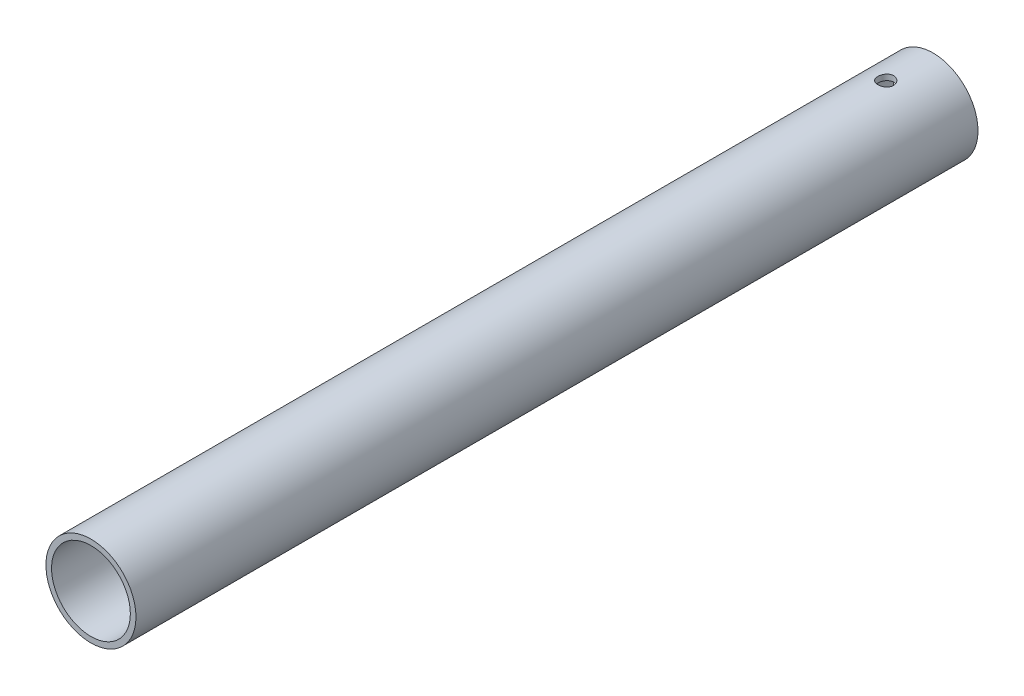
ISO-10303-21;
HEADER;
FILE_DESCRIPTION(('STEP AP214'),'2;1');
FILE_NAME('part.step','',(''),(''),'','','');
FILE_SCHEMA(('AUTOMOTIVE_DESIGN { 1 0 10303 214 1 1 1 1 }'));
ENDSEC;
DATA;
#1=APPLICATION_CONTEXT('core data for automotive mechanical design processes');
#2=APPLICATION_PROTOCOL_DEFINITION('international standard','automotive_design',2000,#1);
#3=PRODUCT_CONTEXT('',#1,'mechanical');
#4=PRODUCT('Part','Part','',(#3));
#5=PRODUCT_RELATED_PRODUCT_CATEGORY('part','',(#4));
#6=PRODUCT_DEFINITION_FORMATION('','',#4);
#7=PRODUCT_DEFINITION_CONTEXT('part definition',#1,'design');
#8=PRODUCT_DEFINITION('design','',#6,#7);
#9=PRODUCT_DEFINITION_SHAPE('','',#8);
#10=(LENGTH_UNIT() NAMED_UNIT(*) SI_UNIT(.MILLI.,.METRE.));
#11=(NAMED_UNIT(*) PLANE_ANGLE_UNIT() SI_UNIT($,.RADIAN.));
#12=(NAMED_UNIT(*) SI_UNIT($,.STERADIAN.) SOLID_ANGLE_UNIT());
#13=UNCERTAINTY_MEASURE_WITH_UNIT(LENGTH_MEASURE(1.E-05),#10,'distance_accuracy_value','');
#14=(GEOMETRIC_REPRESENTATION_CONTEXT(3) GLOBAL_UNCERTAINTY_ASSIGNED_CONTEXT((#13)) GLOBAL_UNIT_ASSIGNED_CONTEXT((#10,
#11,#12)) REPRESENTATION_CONTEXT('',''));
#15=CARTESIAN_POINT('',(0.,0.,0.));
#16=DIRECTION('',(0.,0.,1.));
#17=DIRECTION('',(1.,0.,0.));
#18=AXIS2_PLACEMENT_3D('',#15,#16,#17);
#19=CARTESIAN_POINT('',(0.,0.,149.6));
#20=DIRECTION('',(0.,0.,1.));
#21=DIRECTION('',(1.,0.,0.));
#22=AXIS2_PLACEMENT_3D('',#19,#20,#21);
#23=PLANE('',#22);
#24=CARTESIAN_POINT('',(0.,0.,149.6));
#25=DIRECTION('',(0.,0.,1.));
#26=DIRECTION('',(1.,0.,0.));
#27=AXIS2_PLACEMENT_3D('',#24,#25,#26);
#28=CIRCLE('',#27,8.);
#29=CARTESIAN_POINT('',(8.,0.,149.6));
#30=VERTEX_POINT('',#29);
#31=EDGE_CURVE('E10',#30,#30,#28,.T.);
#32=ORIENTED_EDGE('',*,*,#31,.T.);
#33=EDGE_LOOP('',(#32));
#34=FACE_BOUND('',#33,.T.);
#35=CARTESIAN_POINT('',(0.,0.,149.6));
#36=DIRECTION('',(0.,0.,1.));
#37=DIRECTION('',(1.,0.,0.));
#38=AXIS2_PLACEMENT_3D('',#35,#36,#37);
#39=CIRCLE('',#38,7.);
#40=CARTESIAN_POINT('',(7.,0.,149.6));
#41=VERTEX_POINT('',#40);
#42=EDGE_CURVE('E51',#41,#41,#39,.T.);
#43=ORIENTED_EDGE('',*,*,#42,.F.);
#44=EDGE_LOOP('',(#43));
#45=FACE_BOUND('',#44,.T.);
#46=ADVANCED_FACE('F33',(#34,#45),#23,.T.);
#47=CARTESIAN_POINT('',(0.,0.,0.));
#48=DIRECTION('',(0.,0.,1.));
#49=DIRECTION('',(1.,0.,0.));
#50=AXIS2_PLACEMENT_3D('',#47,#48,#49);
#51=PLANE('',#50);
#52=CARTESIAN_POINT('',(0.,0.,0.));
#53=DIRECTION('',(0.,0.,1.));
#54=DIRECTION('',(1.,0.,0.));
#55=AXIS2_PLACEMENT_3D('',#52,#53,#54);
#56=CIRCLE('',#55,8.);
#57=CARTESIAN_POINT('',(8.,0.,0.));
#58=VERTEX_POINT('',#57);
#59=EDGE_CURVE('E46',#58,#58,#56,.T.);
#60=ORIENTED_EDGE('',*,*,#59,.F.);
#61=EDGE_LOOP('',(#60));
#62=FACE_BOUND('',#61,.T.);
#63=CARTESIAN_POINT('',(0.,0.,0.));
#64=DIRECTION('',(0.,0.,1.));
#65=DIRECTION('',(1.,0.,0.));
#66=AXIS2_PLACEMENT_3D('',#63,#64,#65);
#67=CIRCLE('',#66,7.);
#68=CARTESIAN_POINT('',(7.,0.,0.));
#69=VERTEX_POINT('',#68);
#70=EDGE_CURVE('E54',#69,#69,#67,.T.);
#71=ORIENTED_EDGE('',*,*,#70,.T.);
#72=EDGE_LOOP('',(#71));
#73=FACE_BOUND('',#72,.T.);
#74=ADVANCED_FACE('F87',(#62,#73),#51,.F.);
#75=CARTESIAN_POINT('',(0.,0.,149.6));
#76=DIRECTION('',(0.,0.,-1.));
#77=DIRECTION('',(-1.,0.,0.));
#78=AXIS2_PLACEMENT_3D('',#75,#76,#77);
#79=CYLINDRICAL_SURFACE('',#78,8.);
#80=CARTESIAN_POINT('',(0.,-8.,9.8));
#81=CARTESIAN_POINT('',(0.0780001751982829,-7.99999862840794,9.79999692611606));
#82=CARTESIAN_POINT('',(0.156041460388733,-7.99884740244651,9.79345937499059));
#83=CARTESIAN_POINT('',(0.309931215090021,-7.99436582981276,9.76749507603401));
#84=CARTESIAN_POINT('',(0.385777669375428,-7.99103354295155,9.74805685203911));
#85=CARTESIAN_POINT('',(0.533029372885324,-7.98256322233296,9.69689940960398));
#86=CARTESIAN_POINT('',(0.604438342110772,-7.97742672577381,9.66519064341269));
#87=CARTESIAN_POINT('',(0.740914380295737,-7.96591125756999,9.59042049275119));
#88=CARTESIAN_POINT('',(0.805982091136898,-7.95953241187611,9.54736025894958));
#89=CARTESIAN_POINT('',(0.928619664519326,-7.94616333498248,9.45062911217629));
#90=CARTESIAN_POINT('',(0.986113319848819,-7.93916792163052,9.39686228828627));
#91=CARTESIAN_POINT('',(1.09131207719895,-7.92539333056962,9.28045061045183));
#92=CARTESIAN_POINT('',(1.1390165295148,-7.91861416723829,9.21780516770388));
#93=CARTESIAN_POINT('',(1.22359263935587,-7.90598940099176,9.08488514981881));
#94=CARTESIAN_POINT('',(1.26038809619578,-7.90015048940322,9.01456139751727));
#95=CARTESIAN_POINT('',(1.32161424136418,-7.8901396895929,8.86861168607376));
#96=CARTESIAN_POINT('',(1.34604585332424,-7.88596767685162,8.79298612348013));
#97=CARTESIAN_POINT('',(1.38160892847224,-7.8798148713654,8.63939037484686));
#98=CARTESIAN_POINT('',(1.39287248959928,-7.87781233032342,8.5614516623246));
#99=CARTESIAN_POINT('',(1.4021894800746,-7.8761595054902,8.40476682590526));
#100=CARTESIAN_POINT('',(1.40024394023127,-7.87650903814843,8.32602076549064));
#101=CARTESIAN_POINT('',(1.38330536571091,-7.8795010322133,8.17090491965378));
#102=CARTESIAN_POINT('',(1.36846142113836,-7.88211729196636,8.09451827428744));
#103=CARTESIAN_POINT('',(1.32638169291944,-7.88930688598158,7.94533661412627));
#104=CARTESIAN_POINT('',(1.29914544473986,-7.89388029360824,7.87254173408439));
#105=CARTESIAN_POINT('',(1.23290516888148,-7.90449682748977,7.73216756439309));
#106=CARTESIAN_POINT('',(1.19383989394347,-7.91054757059615,7.66461777611129));
#107=CARTESIAN_POINT('',(1.10509390234727,-7.92343182192952,7.53697570473525));
#108=CARTESIAN_POINT('',(1.05541224334012,-7.93026539961878,7.47688408440422));
#109=CARTESIAN_POINT('',(0.946034723012705,-7.94406011076401,7.36500173240099));
#110=CARTESIAN_POINT('',(0.886211094489709,-7.95102170984661,7.31333588354608));
#111=CARTESIAN_POINT('',(0.758678144941896,-7.96420180074153,7.22075604461968));
#112=CARTESIAN_POINT('',(0.690968762974274,-7.97042028681018,7.17984213764948));
#113=CARTESIAN_POINT('',(0.549463949214038,-7.98142370312536,7.10991351347525));
#114=CARTESIAN_POINT('',(0.475662575179346,-7.98620721208566,7.08091058318721));
#115=CARTESIAN_POINT('',(0.324133596898234,-7.99379047518485,7.03574708245099));
#116=CARTESIAN_POINT('',(0.246406355934079,-7.99659041251566,7.01958532604486));
#117=CARTESIAN_POINT('',(0.0903076437528181,-7.99986621774948,7.00073398781956));
#118=CARTESIAN_POINT('',(0.0119574598226938,-8.00037163599558,6.99787309695897));
#119=CARTESIAN_POINT('',(-0.144102279722645,-7.99908265927998,7.00524690085785));
#120=CARTESIAN_POINT('',(-0.221811862467058,-7.99728836221909,7.01548103815089));
#121=CARTESIAN_POINT('',(-0.373849867024189,-7.99161989658908,7.04861191541162));
#122=CARTESIAN_POINT('',(-0.448197497529853,-7.98775978266158,7.07142311952853));
#123=CARTESIAN_POINT('',(-0.592013195796312,-7.97839071503809,7.12896888817555));
#124=CARTESIAN_POINT('',(-0.66148096638654,-7.97288166103328,7.163704178094));
#125=CARTESIAN_POINT('',(-0.794304113647956,-7.96075227223692,7.24449935046074));
#126=CARTESIAN_POINT('',(-0.857593993257694,-7.95412172074481,7.29066534269358));
#127=CARTESIAN_POINT('',(-0.975589608134911,-7.94051378582851,7.3928664001065));
#128=CARTESIAN_POINT('',(-1.03029465098563,-7.93353637448778,7.44890226057575));
#129=CARTESIAN_POINT('',(-1.13020891995216,-7.91992459791039,7.57002359604892));
#130=CARTESIAN_POINT('',(-1.17530193940062,-7.91329508970106,7.63520556487503));
#131=CARTESIAN_POINT('',(-1.2538984579292,-7.9012230956647,7.77231986456298));
#132=CARTESIAN_POINT('',(-1.28740235061652,-7.89578056952593,7.84425196606125));
#133=CARTESIAN_POINT('',(-1.34169922986161,-7.88673585998126,7.99251129823504));
#134=CARTESIAN_POINT('',(-1.36254828420234,-7.88312557061504,8.06881747810108));
#135=CARTESIAN_POINT('',(-1.39111882773692,-7.87813445048499,8.22391786032735));
#136=CARTESIAN_POINT('',(-1.39884158769243,-7.87675340390793,8.3027118210922));
#137=CARTESIAN_POINT('',(-1.40090212237177,-7.87638708241942,8.45938936490395));
#138=CARTESIAN_POINT('',(-1.39542294958482,-7.87736904279964,8.53727052382282));
#139=CARTESIAN_POINT('',(-1.37163288257493,-7.88154595902748,8.69098409870212));
#140=CARTESIAN_POINT('',(-1.35332204271184,-7.88474090550006,8.76681652334036));
#141=CARTESIAN_POINT('',(-1.30446134075789,-7.89297082662608,8.91419851415472));
#142=CARTESIAN_POINT('',(-1.27392881621193,-7.89800319385042,8.98575398300429));
#143=CARTESIAN_POINT('',(-1.20151068594837,-7.90934317668917,9.12275634223692));
#144=CARTESIAN_POINT('',(-1.15962442341396,-7.91565086607596,9.18820287892204));
#145=CARTESIAN_POINT('',(-1.06504101398315,-7.92893382114375,9.31205142979423));
#146=CARTESIAN_POINT('',(-1.01220974023825,-7.93591673369867,9.3703502067662));
#147=CARTESIAN_POINT('',(-0.897517772698222,-7.94970383407225,9.47731696014494));
#148=CARTESIAN_POINT('',(-0.835655003115262,-7.95650798037813,9.52598271643599));
#149=CARTESIAN_POINT('',(-0.704088149914294,-7.96923191507494,9.61264752531508));
#150=CARTESIAN_POINT('',(-0.634327380395853,-7.97514449399176,9.65056159928381));
#151=CARTESIAN_POINT('',(-0.489349301034037,-7.98534894319633,9.7140730206958));
#152=CARTESIAN_POINT('',(-0.414137389640112,-7.98964239150885,9.73968236718767));
#153=CARTESIAN_POINT('',(-0.282216376006102,-7.99521152220681,9.77243646451179));
#154=CARTESIAN_POINT('',(-0.226295502484523,-7.99699739577273,9.78275581355877));
#155=CARTESIAN_POINT('',(-0.113590342513894,-7.99939212225497,9.7965386315075));
#156=CARTESIAN_POINT('',(-0.0568060734981141,-8.00000099890493,9.80000223865237));
#157=CARTESIAN_POINT('',(0.,-8.,9.8));
#158=B_SPLINE_CURVE_WITH_KNOTS('',3,(#80,#81,#82,#83,#84,#85,#86,#87,#88,#89,#90,#91,#92,#93,
#94,#95,#96,#97,#98,#99,#100,#101,#102,#103,#104,#105,#106,#107,#108,#109,#110,#111,#112,#113,
#114,#115,#116,#117,#118,#119,#120,#121,#122,#123,#124,#125,#126,#127,#128,#129,#130,#131,#132,
#133,#134,#135,#136,#137,#138,#139,#140,#141,#142,#143,#144,#145,#146,#147,#148,#149,#150,#151,
#152,#153,#154,#155,#156,#157),.UNSPECIFIED.,.T.,.F.,(4,2,2,2,2,2,2,2,2,2,2,2,2,2,2,2,2,2,2,2,2,
2,2,2,2,2,2,2,2,2,2,2,2,2,2,2,2,2,4),(0.,0.233792844733947,0.467793945871819,0.701596158243966,
0.935374679803654,1.17135013119218,1.40734123909815,1.64494390605394,1.8825288204635,
2.1177093276277,2.35287148204761,2.58535106672593,2.81783936676386,3.05155262682906,
3.28528664075953,3.52222003892784,3.75915526829015,3.99632440332746,4.23347163185304,
4.46755589242396,4.70163018816148,4.93413185201723,5.1666476623572,5.40140860563451,
5.63618847401937,5.87366328975121,6.11113003921753,6.34753685305678,6.58392077895654,
6.81704600896559,7.05017025137284,7.28296495175658,7.51577312225181,7.75162370751976,
7.98752858598473,8.22524909733822,8.46273732086145,8.63300772472175,8.80327469511674),.UNSPECIFIED.);
#159=CARTESIAN_POINT('',(0.,-8.,9.8));
#160=VERTEX_POINT('',#159);
#161=EDGE_CURVE('E77',#160,#160,#158,.T.);
#162=ORIENTED_EDGE('',*,*,#161,.T.);
#163=EDGE_LOOP('',(#162));
#164=FACE_BOUND('',#163,.T.);
#165=CARTESIAN_POINT('',(0.,8.,9.8));
#166=CARTESIAN_POINT('',(-0.0780001751982829,7.99999862840794,9.79999692611606));
#167=CARTESIAN_POINT('',(-0.156041460388733,7.99884740244651,9.79345937499059));
#168=CARTESIAN_POINT('',(-0.309931215090021,7.99436582981276,9.76749507603401));
#169=CARTESIAN_POINT('',(-0.385777669375428,7.99103354295155,9.74805685203911));
#170=CARTESIAN_POINT('',(-0.533029372885324,7.98256322233296,9.69689940960398));
#171=CARTESIAN_POINT('',(-0.604438342110772,7.97742672577381,9.66519064341269));
#172=CARTESIAN_POINT('',(-0.740914380295737,7.96591125756999,9.59042049275119));
#173=CARTESIAN_POINT('',(-0.805982091136898,7.95953241187611,9.54736025894958));
#174=CARTESIAN_POINT('',(-0.928619664519326,7.94616333498248,9.45062911217629));
#175=CARTESIAN_POINT('',(-0.986113319848819,7.93916792163052,9.39686228828627));
#176=CARTESIAN_POINT('',(-1.09131207719895,7.92539333056962,9.28045061045183));
#177=CARTESIAN_POINT('',(-1.1390165295148,7.91861416723829,9.21780516770388));
#178=CARTESIAN_POINT('',(-1.22359263935587,7.90598940099176,9.08488514981881));
#179=CARTESIAN_POINT('',(-1.26038809619578,7.90015048940322,9.01456139751727));
#180=CARTESIAN_POINT('',(-1.32161424136418,7.8901396895929,8.86861168607376));
#181=CARTESIAN_POINT('',(-1.34604585332424,7.88596767685162,8.79298612348013));
#182=CARTESIAN_POINT('',(-1.38160892847224,7.8798148713654,8.63939037484686));
#183=CARTESIAN_POINT('',(-1.39287248959928,7.87781233032342,8.5614516623246));
#184=CARTESIAN_POINT('',(-1.4021894800746,7.8761595054902,8.40476682590526));
#185=CARTESIAN_POINT('',(-1.40024394023127,7.87650903814843,8.32602076549064));
#186=CARTESIAN_POINT('',(-1.38330536571091,7.8795010322133,8.17090491965378));
#187=CARTESIAN_POINT('',(-1.36846142113836,7.88211729196636,8.09451827428744));
#188=CARTESIAN_POINT('',(-1.32638169291944,7.88930688598158,7.94533661412627));
#189=CARTESIAN_POINT('',(-1.29914544473986,7.89388029360824,7.87254173408439));
#190=CARTESIAN_POINT('',(-1.23290516888148,7.90449682748977,7.73216756439309));
#191=CARTESIAN_POINT('',(-1.19383989394347,7.91054757059615,7.66461777611129));
#192=CARTESIAN_POINT('',(-1.10509390234727,7.92343182192952,7.53697570473525));
#193=CARTESIAN_POINT('',(-1.05541224334012,7.93026539961878,7.47688408440422));
#194=CARTESIAN_POINT('',(-0.946034723012705,7.94406011076401,7.36500173240099));
#195=CARTESIAN_POINT('',(-0.886211094489709,7.95102170984661,7.31333588354608));
#196=CARTESIAN_POINT('',(-0.758678144941896,7.96420180074153,7.22075604461968));
#197=CARTESIAN_POINT('',(-0.690968762974274,7.97042028681018,7.17984213764948));
#198=CARTESIAN_POINT('',(-0.549463949214038,7.98142370312536,7.10991351347525));
#199=CARTESIAN_POINT('',(-0.475662575179346,7.98620721208566,7.08091058318721));
#200=CARTESIAN_POINT('',(-0.324133596898234,7.99379047518485,7.03574708245099));
#201=CARTESIAN_POINT('',(-0.246406355934079,7.99659041251566,7.01958532604486));
#202=CARTESIAN_POINT('',(-0.0903076437528181,7.99986621774948,7.00073398781956));
#203=CARTESIAN_POINT('',(-0.0119574598226938,8.00037163599558,6.99787309695897));
#204=CARTESIAN_POINT('',(0.144102279722645,7.99908265927998,7.00524690085785));
#205=CARTESIAN_POINT('',(0.221811862467058,7.99728836221909,7.01548103815089));
#206=CARTESIAN_POINT('',(0.373849867024189,7.99161989658908,7.04861191541162));
#207=CARTESIAN_POINT('',(0.448197497529853,7.98775978266158,7.07142311952853));
#208=CARTESIAN_POINT('',(0.592013195796312,7.97839071503809,7.12896888817555));
#209=CARTESIAN_POINT('',(0.66148096638654,7.97288166103328,7.163704178094));
#210=CARTESIAN_POINT('',(0.794304113647956,7.96075227223692,7.24449935046074));
#211=CARTESIAN_POINT('',(0.857593993257694,7.95412172074481,7.29066534269358));
#212=CARTESIAN_POINT('',(0.975589608134911,7.94051378582851,7.3928664001065));
#213=CARTESIAN_POINT('',(1.03029465098563,7.93353637448778,7.44890226057575));
#214=CARTESIAN_POINT('',(1.13020891995216,7.91992459791039,7.57002359604892));
#215=CARTESIAN_POINT('',(1.17530193940062,7.91329508970106,7.63520556487503));
#216=CARTESIAN_POINT('',(1.2538984579292,7.9012230956647,7.77231986456298));
#217=CARTESIAN_POINT('',(1.28740235061652,7.89578056952593,7.84425196606125));
#218=CARTESIAN_POINT('',(1.34169922986161,7.88673585998126,7.99251129823504));
#219=CARTESIAN_POINT('',(1.36254828420234,7.88312557061504,8.06881747810108));
#220=CARTESIAN_POINT('',(1.39111882773692,7.87813445048499,8.22391786032735));
#221=CARTESIAN_POINT('',(1.39884158769243,7.87675340390793,8.3027118210922));
#222=CARTESIAN_POINT('',(1.40090212237177,7.87638708241942,8.45938936490395));
#223=CARTESIAN_POINT('',(1.39542294958482,7.87736904279964,8.53727052382282));
#224=CARTESIAN_POINT('',(1.37163288257493,7.88154595902748,8.69098409870212));
#225=CARTESIAN_POINT('',(1.35332204271184,7.88474090550006,8.76681652334036));
#226=CARTESIAN_POINT('',(1.30446134075789,7.89297082662608,8.91419851415472));
#227=CARTESIAN_POINT('',(1.27392881621193,7.89800319385042,8.98575398300429));
#228=CARTESIAN_POINT('',(1.20151068594837,7.90934317668917,9.12275634223692));
#229=CARTESIAN_POINT('',(1.15962442341396,7.91565086607596,9.18820287892204));
#230=CARTESIAN_POINT('',(1.06504101398315,7.92893382114375,9.31205142979423));
#231=CARTESIAN_POINT('',(1.01220974023825,7.93591673369867,9.3703502067662));
#232=CARTESIAN_POINT('',(0.897517772698222,7.94970383407225,9.47731696014494));
#233=CARTESIAN_POINT('',(0.835655003115262,7.95650798037813,9.52598271643599));
#234=CARTESIAN_POINT('',(0.704088149914294,7.96923191507494,9.61264752531508));
#235=CARTESIAN_POINT('',(0.634327380395853,7.97514449399176,9.65056159928381));
#236=CARTESIAN_POINT('',(0.489349301034037,7.98534894319633,9.7140730206958));
#237=CARTESIAN_POINT('',(0.414137389640112,7.98964239150885,9.73968236718767));
#238=CARTESIAN_POINT('',(0.282216376006102,7.99521152220681,9.77243646451179));
#239=CARTESIAN_POINT('',(0.226295502484523,7.99699739577273,9.78275581355877));
#240=CARTESIAN_POINT('',(0.113590342513894,7.99939212225497,9.7965386315075));
#241=CARTESIAN_POINT('',(0.0568060734981141,8.00000099890493,9.80000223865237));
#242=CARTESIAN_POINT('',(0.,8.,9.8));
#243=B_SPLINE_CURVE_WITH_KNOTS('',3,(#165,#166,#167,#168,#169,#170,#171,#172,#173,#174,#175,
#176,#177,#178,#179,#180,#181,#182,#183,#184,#185,#186,#187,#188,#189,#190,#191,#192,#193,#194,
#195,#196,#197,#198,#199,#200,#201,#202,#203,#204,#205,#206,#207,#208,#209,#210,#211,#212,#213,
#214,#215,#216,#217,#218,#219,#220,#221,#222,#223,#224,#225,#226,#227,#228,#229,#230,#231,#232,
#233,#234,#235,#236,#237,#238,#239,#240,#241,#242),.UNSPECIFIED.,.T.,.F.,(4,2,2,2,2,2,2,2,2,2,2,
2,2,2,2,2,2,2,2,2,2,2,2,2,2,2,2,2,2,2,2,2,2,2,2,2,2,2,4),(0.,0.233792844733947,
0.467793945871819,0.701596158243966,0.935374679803654,1.17135013119218,1.40734123909815,
1.64494390605394,1.8825288204635,2.1177093276277,2.35287148204761,2.58535106672593,
2.81783936676386,3.05155262682906,3.28528664075953,3.52222003892784,3.75915526829015,
3.99632440332746,4.23347163185304,4.46755589242396,4.70163018816148,4.93413185201723,
5.1666476623572,5.40140860563451,5.63618847401937,5.87366328975121,6.11113003921753,
6.34753685305678,6.58392077895654,6.81704600896559,7.05017025137284,7.28296495175658,
7.51577312225181,7.75162370751976,7.98752858598473,8.22524909733822,8.46273732086145,
8.63300772472175,8.80327469511674),.UNSPECIFIED.);
#244=CARTESIAN_POINT('',(0.,8.,9.8));
#245=VERTEX_POINT('',#244);
#246=EDGE_CURVE('E73',#245,#245,#243,.T.);
#247=ORIENTED_EDGE('',*,*,#246,.T.);
#248=EDGE_LOOP('',(#247));
#249=FACE_BOUND('',#248,.T.);
#250=ORIENTED_EDGE('',*,*,#31,.F.);
#251=EDGE_LOOP('',(#250));
#252=FACE_BOUND('',#251,.T.);
#253=ORIENTED_EDGE('',*,*,#59,.T.);
#254=EDGE_LOOP('',(#253));
#255=FACE_BOUND('',#254,.T.);
#256=ADVANCED_FACE('F35',(#164,#249,#252,#255),#79,.T.);
#257=CARTESIAN_POINT('',(0.,0.,149.6));
#258=DIRECTION('',(0.,0.,-1.));
#259=DIRECTION('',(-1.,0.,0.));
#260=AXIS2_PLACEMENT_3D('',#257,#258,#259);
#261=CYLINDRICAL_SURFACE('',#260,7.);
#262=CARTESIAN_POINT('',(0.,-7.,9.8));
#263=CARTESIAN_POINT('',(0.0778076695096864,-6.9999985661322,9.79999713770232));
#264=CARTESIAN_POINT('',(0.155651524282131,-6.99868939249524,9.7934916198453));
#265=CARTESIAN_POINT('',(0.309138910764627,-6.99359311872524,9.76766209983866));
#266=CARTESIAN_POINT('',(0.384780644557898,-6.98980405004261,9.74832791407789));
#267=CARTESIAN_POINT('',(0.531622427368638,-6.98017108989602,9.6974622169309));
#268=CARTESIAN_POINT('',(0.602826655106388,-6.97432916707406,9.66594238841744));
#269=CARTESIAN_POINT('',(0.738931184409916,-6.9612255724944,9.59163485348419));
#270=CARTESIAN_POINT('',(0.803831861106136,-6.9539639852999,9.54884781814991));
#271=CARTESIAN_POINT('',(0.926370868240811,-6.93871031461958,9.452606107992));
#272=CARTESIAN_POINT('',(0.983911531621933,-6.93071043706087,9.39902830245232));
#273=CARTESIAN_POINT('',(1.08925145925124,-6.91493852633624,9.28299061705162));
#274=CARTESIAN_POINT('',(1.13704996267859,-6.90716651100593,9.22053004413084));
#275=CARTESIAN_POINT('',(1.22196445468667,-6.89265418537661,9.08779732978338));
#276=CARTESIAN_POINT('',(1.25897931441221,-6.88592390310925,9.0174592986851));
#277=CARTESIAN_POINT('',(1.32062793321243,-6.87436775281785,8.87140545339429));
#278=CARTESIAN_POINT('',(1.34526291541213,-6.86954169666747,8.79569017131512));
#279=CARTESIAN_POINT('',(1.38113541983876,-6.86241927353086,8.64208189052892));
#280=CARTESIAN_POINT('',(1.39254429714229,-6.86009058150063,8.56423043820089));
#281=CARTESIAN_POINT('',(1.40217297881657,-6.85812925084878,8.40768625008992));
#282=CARTESIAN_POINT('',(1.4003941317989,-6.85849633654977,8.3289936011518));
#283=CARTESIAN_POINT('',(1.38383640234255,-6.86185571607459,8.1742544967706));
#284=CARTESIAN_POINT('',(1.36925395634147,-6.86480834002269,8.09818603212176));
#285=CARTESIAN_POINT('',(1.32781303847227,-6.87294364624002,7.9495974926718));
#286=CARTESIAN_POINT('',(1.30095398034095,-6.8781264350089,7.87707758751339));
#287=CARTESIAN_POINT('',(1.23553469714461,-6.89017865900571,7.73707863361496));
#288=CARTESIAN_POINT('',(1.19689661172496,-6.89705925739186,7.66963696860316));
#289=CARTESIAN_POINT('',(1.10907100440175,-6.91172466282287,7.54212081003806));
#290=CARTESIAN_POINT('',(1.05988227009956,-6.91950957373712,7.48204716440838));
#291=CARTESIAN_POINT('',(0.951299908384818,-6.93527829738047,7.36983883656029));
#292=CARTESIAN_POINT('',(0.891738625697423,-6.94326316895267,7.31786640499722));
#293=CARTESIAN_POINT('',(0.764659033686813,-6.95840388200172,7.22462461517829));
#294=CARTESIAN_POINT('',(0.697140622331144,-6.96555971284563,7.18335539418899));
#295=CARTESIAN_POINT('',(0.555883141630488,-6.97825366225242,7.11266148708364));
#296=CARTESIAN_POINT('',(0.482134547419419,-6.98378924387581,7.08325534889765));
#297=CARTESIAN_POINT('',(0.33060856702813,-6.99259972583002,7.03729533634601));
#298=CARTESIAN_POINT('',(0.252831670101429,-6.99587490000744,7.02073990509692));
#299=CARTESIAN_POINT('',(0.0968511678780104,-6.99975740613615,7.00118096468801));
#300=CARTESIAN_POINT('',(0.0186764596558065,-7.00040844513458,6.99795541264363));
#301=CARTESIAN_POINT('',(-0.1370949078698,-6.99909072702144,7.00454980251905));
#302=CARTESIAN_POINT('',(-0.214691599421311,-6.99712211718025,7.01436901109363));
#303=CARTESIAN_POINT('',(-0.366387923925157,-6.99081364811225,7.04658972296154));
#304=CARTESIAN_POINT('',(-0.440512727675864,-6.98649526965889,7.06887729589707));
#305=CARTESIAN_POINT('',(-0.583973078499534,-6.97596972885446,7.12527757571814));
#306=CARTESIAN_POINT('',(-0.653308266292555,-6.96976242499918,7.15939116854756));
#307=CARTESIAN_POINT('',(-0.786157643160705,-6.95603876146612,7.23895548691184));
#308=CARTESIAN_POINT('',(-0.849590177453063,-6.94850730611873,7.28453989345453));
#309=CARTESIAN_POINT('',(-0.967985226766889,-6.93300628761835,7.3855728676902));
#310=CARTESIAN_POINT('',(-1.02294683250307,-6.92503667755743,7.44102249295981));
#311=CARTESIAN_POINT('',(-1.12369682708385,-6.90941024979751,7.56122269264757));
#312=CARTESIAN_POINT('',(-1.16933278342812,-6.90176004326626,7.62610204190987));
#313=CARTESIAN_POINT('',(-1.24905958807169,-6.88777868514672,7.76273590589935));
#314=CARTESIAN_POINT('',(-1.28315089829206,-6.8814474807868,7.83449014540298));
#315=CARTESIAN_POINT('',(-1.33861257821474,-6.87087436818136,7.98247554460937));
#316=CARTESIAN_POINT('',(-1.36004889970747,-6.86662164821061,8.05868117769445));
#317=CARTESIAN_POINT('',(-1.38979211227807,-6.86066411508835,8.21370683488727));
#318=CARTESIAN_POINT('',(-1.39810071551516,-6.85895896967556,8.29252651669309));
#319=CARTESIAN_POINT('',(-1.40128927521446,-6.85830809483931,8.44901241036205));
#320=CARTESIAN_POINT('',(-1.39641010329925,-6.85931286865021,8.52667360849781));
#321=CARTESIAN_POINT('',(-1.37389322574008,-6.8638580287846,8.68004430986704));
#322=CARTESIAN_POINT('',(-1.35625562258102,-6.86739839474037,8.75575382877273));
#323=CARTESIAN_POINT('',(-1.30882999589854,-6.87659369906822,8.90291879573676));
#324=CARTESIAN_POINT('',(-1.27907150940428,-6.88224349426363,8.97438410470338));
#325=CARTESIAN_POINT('',(-1.20827650244225,-6.89502400963839,9.11134520902822));
#326=CARTESIAN_POINT('',(-1.16723903628484,-6.90215485398452,9.17684050321519));
#327=CARTESIAN_POINT('',(-1.07422828070098,-6.91724544732516,9.30120180101044));
#328=CARTESIAN_POINT('',(-1.02208104212925,-6.92521722073579,9.35993627137463));
#329=CARTESIAN_POINT('',(-0.908690116618397,-6.94100514620737,9.46790068774084));
#330=CARTESIAN_POINT('',(-0.847444342014669,-6.94882126208458,9.51712844644418));
#331=CARTESIAN_POINT('',(-0.716824680723546,-6.9635136534316,9.60516850152503));
#332=CARTESIAN_POINT('',(-0.647372438201769,-6.97037923706945,9.64386640459204));
#333=CARTESIAN_POINT('',(-0.502832905317026,-6.98229175119,9.70898057163523));
#334=CARTESIAN_POINT('',(-0.427750765208377,-6.98734031994062,9.73540790534549));
#335=CARTESIAN_POINT('',(-0.293750084493291,-6.99406921633519,9.7701127272626));
#336=CARTESIAN_POINT('',(-0.235594329619299,-6.99628024421833,9.78130047119086));
#337=CARTESIAN_POINT('',(-0.118299335294094,-6.9992461579585,9.79624507730171));
#338=CARTESIAN_POINT('',(-0.0591601272480667,-7.00000109022417,9.80000217631368));
#339=CARTESIAN_POINT('',(0.,-7.,9.8));
#340=B_SPLINE_CURVE_WITH_KNOTS('',3,(#262,#263,#264,#265,#266,#267,#268,#269,#270,#271,#272,
#273,#274,#275,#276,#277,#278,#279,#280,#281,#282,#283,#284,#285,#286,#287,#288,#289,#290,#291,
#292,#293,#294,#295,#296,#297,#298,#299,#300,#301,#302,#303,#304,#305,#306,#307,#308,#309,#310,
#311,#312,#313,#314,#315,#316,#317,#318,#319,#320,#321,#322,#323,#324,#325,#326,#327,#328,#329,
#330,#331,#332,#333,#334,#335,#336,#337,#338,#339),.UNSPECIFIED.,.T.,.F.,(4,2,2,2,2,2,2,2,2,2,2,
2,2,2,2,2,2,2,2,2,2,2,2,2,2,2,2,2,2,2,2,2,2,2,2,2,2,2,4),(0.,0.233206582925762,
0.466598510967852,0.699767229350478,0.932922063123207,1.16890573815706,1.40490783544631,
1.64305673008292,1.88118209111276,2.11618659145022,2.35116705993715,2.5826041780879,
2.81405234955222,3.0470648628503,3.28010416649539,3.51733553487891,3.75456994555748,
3.99217384795634,4.2297489597725,4.46335029946771,4.69693850721015,4.92842635531013,
5.15993154902431,5.39427092446702,5.62863543684302,5.86656880010916,6.10449264212853,
6.34116533445812,6.5778071566258,6.81015611594782,7.04250320889652,7.27428745754354,
7.50609114614613,7.741833067348,7.97762916346103,8.21589295345892,8.45394137724526,
8.63126285405852,8.80857867919394),.UNSPECIFIED.);
#341=CARTESIAN_POINT('',(0.,-7.,9.8));
#342=VERTEX_POINT('',#341);
#343=EDGE_CURVE('E38',#342,#342,#340,.T.);
#344=ORIENTED_EDGE('',*,*,#343,.F.);
#345=EDGE_LOOP('',(#344));
#346=FACE_BOUND('',#345,.T.);
#347=CARTESIAN_POINT('',(0.,7.,9.8));
#348=CARTESIAN_POINT('',(-0.0778076695096864,6.9999985661322,9.79999713770232));
#349=CARTESIAN_POINT('',(-0.155651524282131,6.99868939249524,9.7934916198453));
#350=CARTESIAN_POINT('',(-0.309138910764627,6.99359311872524,9.76766209983866));
#351=CARTESIAN_POINT('',(-0.384780644557898,6.98980405004261,9.74832791407789));
#352=CARTESIAN_POINT('',(-0.531622427368638,6.98017108989602,9.6974622169309));
#353=CARTESIAN_POINT('',(-0.602826655106388,6.97432916707406,9.66594238841744));
#354=CARTESIAN_POINT('',(-0.738931184409916,6.9612255724944,9.59163485348419));
#355=CARTESIAN_POINT('',(-0.803831861106136,6.9539639852999,9.54884781814991));
#356=CARTESIAN_POINT('',(-0.926370868240811,6.93871031461958,9.452606107992));
#357=CARTESIAN_POINT('',(-0.983911531621933,6.93071043706087,9.39902830245232));
#358=CARTESIAN_POINT('',(-1.08925145925124,6.91493852633624,9.28299061705162));
#359=CARTESIAN_POINT('',(-1.13704996267859,6.90716651100593,9.22053004413084));
#360=CARTESIAN_POINT('',(-1.22196445468667,6.89265418537661,9.08779732978338));
#361=CARTESIAN_POINT('',(-1.25897931441221,6.88592390310925,9.0174592986851));
#362=CARTESIAN_POINT('',(-1.32062793321243,6.87436775281785,8.87140545339429));
#363=CARTESIAN_POINT('',(-1.34526291541213,6.86954169666747,8.79569017131512));
#364=CARTESIAN_POINT('',(-1.38113541983876,6.86241927353086,8.64208189052892));
#365=CARTESIAN_POINT('',(-1.39254429714229,6.86009058150063,8.56423043820089));
#366=CARTESIAN_POINT('',(-1.40217297881657,6.85812925084878,8.40768625008992));
#367=CARTESIAN_POINT('',(-1.4003941317989,6.85849633654977,8.3289936011518));
#368=CARTESIAN_POINT('',(-1.38383640234255,6.86185571607459,8.1742544967706));
#369=CARTESIAN_POINT('',(-1.36925395634147,6.86480834002269,8.09818603212176));
#370=CARTESIAN_POINT('',(-1.32781303847227,6.87294364624002,7.9495974926718));
#371=CARTESIAN_POINT('',(-1.30095398034095,6.8781264350089,7.87707758751339));
#372=CARTESIAN_POINT('',(-1.23553469714461,6.89017865900571,7.73707863361496));
#373=CARTESIAN_POINT('',(-1.19689661172496,6.89705925739186,7.66963696860316));
#374=CARTESIAN_POINT('',(-1.10907100440175,6.91172466282287,7.54212081003806));
#375=CARTESIAN_POINT('',(-1.05988227009956,6.91950957373712,7.48204716440838));
#376=CARTESIAN_POINT('',(-0.951299908384818,6.93527829738047,7.36983883656029));
#377=CARTESIAN_POINT('',(-0.891738625697423,6.94326316895267,7.31786640499722));
#378=CARTESIAN_POINT('',(-0.764659033686813,6.95840388200172,7.22462461517829));
#379=CARTESIAN_POINT('',(-0.697140622331144,6.96555971284563,7.18335539418899));
#380=CARTESIAN_POINT('',(-0.555883141630488,6.97825366225242,7.11266148708364));
#381=CARTESIAN_POINT('',(-0.482134547419419,6.98378924387581,7.08325534889765));
#382=CARTESIAN_POINT('',(-0.33060856702813,6.99259972583002,7.03729533634601));
#383=CARTESIAN_POINT('',(-0.252831670101429,6.99587490000744,7.02073990509692));
#384=CARTESIAN_POINT('',(-0.0968511678780104,6.99975740613615,7.00118096468801));
#385=CARTESIAN_POINT('',(-0.0186764596558065,7.00040844513458,6.99795541264363));
#386=CARTESIAN_POINT('',(0.1370949078698,6.99909072702144,7.00454980251905));
#387=CARTESIAN_POINT('',(0.214691599421311,6.99712211718025,7.01436901109363));
#388=CARTESIAN_POINT('',(0.366387923925157,6.99081364811225,7.04658972296154));
#389=CARTESIAN_POINT('',(0.440512727675864,6.98649526965889,7.06887729589707));
#390=CARTESIAN_POINT('',(0.583973078499534,6.97596972885446,7.12527757571814));
#391=CARTESIAN_POINT('',(0.653308266292555,6.96976242499918,7.15939116854756));
#392=CARTESIAN_POINT('',(0.786157643160705,6.95603876146612,7.23895548691184));
#393=CARTESIAN_POINT('',(0.849590177453063,6.94850730611873,7.28453989345453));
#394=CARTESIAN_POINT('',(0.967985226766889,6.93300628761835,7.3855728676902));
#395=CARTESIAN_POINT('',(1.02294683250307,6.92503667755743,7.44102249295981));
#396=CARTESIAN_POINT('',(1.12369682708385,6.90941024979751,7.56122269264757));
#397=CARTESIAN_POINT('',(1.16933278342812,6.90176004326626,7.62610204190987));
#398=CARTESIAN_POINT('',(1.24905958807169,6.88777868514672,7.76273590589935));
#399=CARTESIAN_POINT('',(1.28315089829206,6.8814474807868,7.83449014540298));
#400=CARTESIAN_POINT('',(1.33861257821474,6.87087436818136,7.98247554460937));
#401=CARTESIAN_POINT('',(1.36004889970747,6.86662164821061,8.05868117769445));
#402=CARTESIAN_POINT('',(1.38979211227807,6.86066411508835,8.21370683488727));
#403=CARTESIAN_POINT('',(1.39810071551516,6.85895896967556,8.29252651669309));
#404=CARTESIAN_POINT('',(1.40128927521446,6.85830809483931,8.44901241036205));
#405=CARTESIAN_POINT('',(1.39641010329925,6.85931286865021,8.52667360849781));
#406=CARTESIAN_POINT('',(1.37389322574008,6.8638580287846,8.68004430986704));
#407=CARTESIAN_POINT('',(1.35625562258102,6.86739839474037,8.75575382877273));
#408=CARTESIAN_POINT('',(1.30882999589854,6.87659369906822,8.90291879573676));
#409=CARTESIAN_POINT('',(1.27907150940428,6.88224349426363,8.97438410470338));
#410=CARTESIAN_POINT('',(1.20827650244225,6.89502400963839,9.11134520902822));
#411=CARTESIAN_POINT('',(1.16723903628484,6.90215485398452,9.17684050321519));
#412=CARTESIAN_POINT('',(1.07422828070098,6.91724544732516,9.30120180101044));
#413=CARTESIAN_POINT('',(1.02208104212925,6.92521722073579,9.35993627137463));
#414=CARTESIAN_POINT('',(0.908690116618397,6.94100514620737,9.46790068774084));
#415=CARTESIAN_POINT('',(0.847444342014669,6.94882126208458,9.51712844644418));
#416=CARTESIAN_POINT('',(0.716824680723546,6.9635136534316,9.60516850152503));
#417=CARTESIAN_POINT('',(0.647372438201769,6.97037923706945,9.64386640459204));
#418=CARTESIAN_POINT('',(0.502832905317026,6.98229175119,9.70898057163523));
#419=CARTESIAN_POINT('',(0.427750765208377,6.98734031994062,9.73540790534549));
#420=CARTESIAN_POINT('',(0.293750084493291,6.99406921633519,9.7701127272626));
#421=CARTESIAN_POINT('',(0.235594329619299,6.99628024421833,9.78130047119086));
#422=CARTESIAN_POINT('',(0.118299335294094,6.9992461579585,9.79624507730171));
#423=CARTESIAN_POINT('',(0.0591601272480667,7.00000109022417,9.80000217631368));
#424=CARTESIAN_POINT('',(0.,7.,9.8));
#425=B_SPLINE_CURVE_WITH_KNOTS('',3,(#347,#348,#349,#350,#351,#352,#353,#354,#355,#356,#357,
#358,#359,#360,#361,#362,#363,#364,#365,#366,#367,#368,#369,#370,#371,#372,#373,#374,#375,#376,
#377,#378,#379,#380,#381,#382,#383,#384,#385,#386,#387,#388,#389,#390,#391,#392,#393,#394,#395,
#396,#397,#398,#399,#400,#401,#402,#403,#404,#405,#406,#407,#408,#409,#410,#411,#412,#413,#414,
#415,#416,#417,#418,#419,#420,#421,#422,#423,#424),.UNSPECIFIED.,.T.,.F.,(4,2,2,2,2,2,2,2,2,2,2,
2,2,2,2,2,2,2,2,2,2,2,2,2,2,2,2,2,2,2,2,2,2,2,2,2,2,2,4),(0.,0.233206582925762,
0.466598510967852,0.699767229350478,0.932922063123207,1.16890573815706,1.40490783544631,
1.64305673008292,1.88118209111276,2.11618659145022,2.35116705993715,2.5826041780879,
2.81405234955222,3.0470648628503,3.28010416649539,3.51733553487891,3.75456994555748,
3.99217384795634,4.2297489597725,4.46335029946771,4.69693850721015,4.92842635531013,
5.15993154902431,5.39427092446702,5.62863543684302,5.86656880010916,6.10449264212853,
6.34116533445812,6.5778071566258,6.81015611594782,7.04250320889652,7.27428745754354,
7.50609114614613,7.741833067348,7.97762916346103,8.21589295345892,8.45394137724526,
8.63126285405852,8.80857867919394),.UNSPECIFIED.);
#426=CARTESIAN_POINT('',(0.,7.,9.8));
#427=VERTEX_POINT('',#426);
#428=EDGE_CURVE('E56',#427,#427,#425,.T.);
#429=ORIENTED_EDGE('',*,*,#428,.F.);
#430=EDGE_LOOP('',(#429));
#431=FACE_BOUND('',#430,.T.);
#432=ORIENTED_EDGE('',*,*,#42,.T.);
#433=EDGE_LOOP('',(#432));
#434=FACE_BOUND('',#433,.T.);
#435=ORIENTED_EDGE('',*,*,#70,.F.);
#436=EDGE_LOOP('',(#435));
#437=FACE_BOUND('',#436,.T.);
#438=ADVANCED_FACE('F60',(#346,#431,#434,#437),#261,.F.);
#439=CARTESIAN_POINT('',(0.,-8.,8.4));
#440=DIRECTION('',(0.,1.,0.));
#441=DIRECTION('',(0.,0.,1.));
#442=AXIS2_PLACEMENT_3D('',#439,#440,#441);
#443=CYLINDRICAL_SURFACE('',#442,1.4);
#444=ORIENTED_EDGE('',*,*,#428,.T.);
#445=EDGE_LOOP('',(#444));
#446=FACE_BOUND('',#445,.T.);
#447=ORIENTED_EDGE('',*,*,#246,.F.);
#448=EDGE_LOOP('',(#447));
#449=FACE_BOUND('',#448,.T.);
#450=ADVANCED_FACE('F66',(#446,#449),#443,.F.);
#451=ORIENTED_EDGE('',*,*,#343,.T.);
#452=EDGE_LOOP('',(#451));
#453=FACE_BOUND('',#452,.T.);
#454=ORIENTED_EDGE('',*,*,#161,.F.);
#455=EDGE_LOOP('',(#454));
#456=FACE_BOUND('',#455,.T.);
#457=ADVANCED_FACE('F63',(#453,#456),#443,.F.);
#458=CLOSED_SHELL('',(#46,#74,#256,#438,#450,#457));
#459=MANIFOLD_SOLID_BREP('B2',#458);
#460=ADVANCED_BREP_SHAPE_REPRESENTATION('',(#18,#459),#14);
#461=SHAPE_DEFINITION_REPRESENTATION(#9,#460);
ENDSEC;
END-ISO-10303-21;
